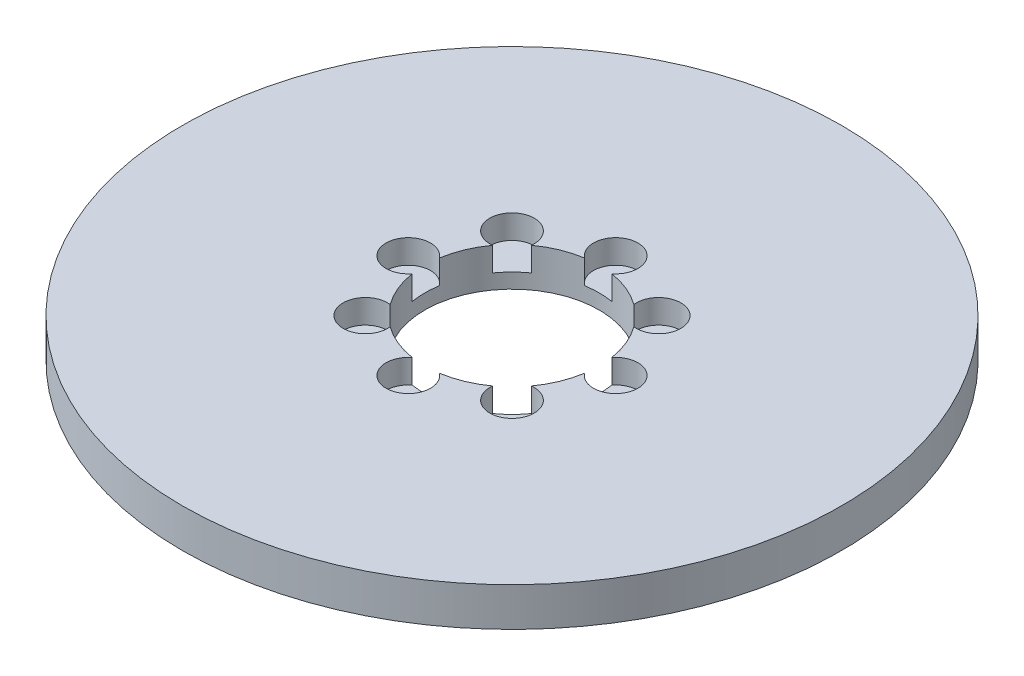
ISO-10303-21;
HEADER;
FILE_DESCRIPTION(('STEP AP214'),'2;1');
FILE_NAME('part.step','',(''),(''),'','','');
FILE_SCHEMA(('AUTOMOTIVE_DESIGN { 1 0 10303 214 1 1 1 1 }'));
ENDSEC;
DATA;
#1=APPLICATION_CONTEXT('core data for automotive mechanical design processes');
#2=APPLICATION_PROTOCOL_DEFINITION('international standard','automotive_design',2000,#1);
#3=PRODUCT_CONTEXT('',#1,'mechanical');
#4=PRODUCT('Part','Part','',(#3));
#5=PRODUCT_RELATED_PRODUCT_CATEGORY('part','',(#4));
#6=PRODUCT_DEFINITION_FORMATION('','',#4);
#7=PRODUCT_DEFINITION_CONTEXT('part definition',#1,'design');
#8=PRODUCT_DEFINITION('design','',#6,#7);
#9=PRODUCT_DEFINITION_SHAPE('','',#8);
#10=(LENGTH_UNIT() NAMED_UNIT(*) SI_UNIT(.MILLI.,.METRE.));
#11=(NAMED_UNIT(*) PLANE_ANGLE_UNIT() SI_UNIT($,.RADIAN.));
#12=(NAMED_UNIT(*) SI_UNIT($,.STERADIAN.) SOLID_ANGLE_UNIT());
#13=UNCERTAINTY_MEASURE_WITH_UNIT(LENGTH_MEASURE(1.E-05),#10,'distance_accuracy_value','');
#14=(GEOMETRIC_REPRESENTATION_CONTEXT(3) GLOBAL_UNCERTAINTY_ASSIGNED_CONTEXT((#13)) GLOBAL_UNIT_ASSIGNED_CONTEXT((#10,
#11,#12)) REPRESENTATION_CONTEXT('',''));
#15=CARTESIAN_POINT('',(0.,0.,0.));
#16=DIRECTION('',(0.,0.,1.));
#17=DIRECTION('',(1.,0.,0.));
#18=AXIS2_PLACEMENT_3D('',#15,#16,#17);
#19=CARTESIAN_POINT('',(0.,10.,0.));
#20=DIRECTION('',(0.,-1.,0.));
#21=DIRECTION('',(0.,0.,-1.));
#22=AXIS2_PLACEMENT_3D('',#19,#20,#21);
#23=CYLINDRICAL_SURFACE('',#22,85.);
#24=CARTESIAN_POINT('',(0.,10.,0.));
#25=DIRECTION('',(0.,1.,0.));
#26=DIRECTION('',(0.,0.,1.));
#27=AXIS2_PLACEMENT_3D('',#24,#25,#26);
#28=CIRCLE('',#27,85.);
#29=CARTESIAN_POINT('',(0.,10.,85.));
#30=VERTEX_POINT('',#29);
#31=EDGE_CURVE('E195',#30,#30,#28,.T.);
#32=ORIENTED_EDGE('',*,*,#31,.F.);
#33=EDGE_LOOP('',(#32));
#34=FACE_BOUND('',#33,.T.);
#35=CARTESIAN_POINT('',(0.,0.,0.));
#36=DIRECTION('',(0.,1.,0.));
#37=DIRECTION('',(0.,0.,1.));
#38=AXIS2_PLACEMENT_3D('',#35,#36,#37);
#39=CIRCLE('',#38,85.);
#40=CARTESIAN_POINT('',(0.,0.,85.));
#41=VERTEX_POINT('',#40);
#42=EDGE_CURVE('E179',#41,#41,#39,.T.);
#43=ORIENTED_EDGE('',*,*,#42,.T.);
#44=EDGE_LOOP('',(#43));
#45=FACE_BOUND('',#44,.T.);
#46=ADVANCED_FACE('F39',(#34,#45),#23,.T.);
#47=CARTESIAN_POINT('',(0.,10.,0.));
#48=DIRECTION('',(0.,1.,0.));
#49=DIRECTION('',(0.,0.,1.));
#50=AXIS2_PLACEMENT_3D('',#47,#48,#49);
#51=PLANE('',#50);
#52=CARTESIAN_POINT('',(0.,10.,26.7445196302618));
#53=DIRECTION('',(0.,1.,0.));
#54=DIRECTION('',(1.,0.,0.));
#55=AXIS2_PLACEMENT_3D('',#52,#53,#54);
#56=CIRCLE('',#55,5.72593359365455);
#57=CARTESIAN_POINT('',(-3.51425212942204,10.,22.2238617699727));
#58=VERTEX_POINT('',#57);
#59=CARTESIAN_POINT('',(3.5142521294222,10.,22.2238617699726));
#60=VERTEX_POINT('',#59);
#61=EDGE_CURVE('E176',#58,#60,#56,.T.);
#62=ORIENTED_EDGE('',*,*,#61,.F.);
#63=CARTESIAN_POINT('',(0.,10.,0.));
#64=DIRECTION('',(0.,1.,0.));
#65=DIRECTION('',(0.,0.,1.));
#66=AXIS2_PLACEMENT_3D('',#63,#64,#65);
#67=CIRCLE('',#66,22.5);
#68=CARTESIAN_POINT('',(-13.2296918501865,10.,18.1995948732138));
#69=VERTEX_POINT('',#68);
#70=EDGE_CURVE('E166',#69,#58,#67,.T.);
#71=ORIENTED_EDGE('',*,*,#70,.F.);
#72=CARTESIAN_POINT('',(-18.9112311901348,10.,18.9112311901349));
#73=DIRECTION('',(0.,1.,0.));
#74=DIRECTION('',(0.707106781186549,0.,0.707106781186546));
#75=AXIS2_PLACEMENT_3D('',#72,#73,#74);
#76=CIRCLE('',#75,5.72593359365455);
#77=CARTESIAN_POINT('',(-18.1995948732138,10.,13.2296918501865));
#78=VERTEX_POINT('',#77);
#79=EDGE_CURVE('E147',#78,#69,#76,.T.);
#80=ORIENTED_EDGE('',*,*,#79,.F.);
#81=CARTESIAN_POINT('',(-22.2238617699727,10.,3.51425212942212));
#82=VERTEX_POINT('',#81);
#83=EDGE_CURVE('E180',#82,#78,#67,.T.);
#84=ORIENTED_EDGE('',*,*,#83,.F.);
#85=CARTESIAN_POINT('',(-26.7445196302618,10.,0.));
#86=DIRECTION('',(0.,1.,0.));
#87=DIRECTION('',(0.,0.,1.));
#88=AXIS2_PLACEMENT_3D('',#85,#86,#87);
#89=CIRCLE('',#88,5.72593359365455);
#90=CARTESIAN_POINT('',(-22.2238617699727,10.,-3.51425212942212));
#91=VERTEX_POINT('',#90);
#92=EDGE_CURVE('E186',#91,#82,#89,.T.);
#93=ORIENTED_EDGE('',*,*,#92,.F.);
#94=CARTESIAN_POINT('',(-18.1995948732139,10.,-13.2296918501863));
#95=VERTEX_POINT('',#94);
#96=EDGE_CURVE('E182',#95,#91,#67,.T.);
#97=ORIENTED_EDGE('',*,*,#96,.F.);
#98=CARTESIAN_POINT('',(-18.9112311901351,10.,-18.9112311901346));
#99=DIRECTION('',(0.,1.,0.));
#100=DIRECTION('',(-0.707106781186539,0.,0.707106781186556));
#101=AXIS2_PLACEMENT_3D('',#98,#99,#100);
#102=CIRCLE('',#101,5.72593359365455);
#103=CARTESIAN_POINT('',(-13.2296918501867,10.,-18.1995948732136));
#104=VERTEX_POINT('',#103);
#105=EDGE_CURVE('E446',#104,#95,#102,.T.);
#106=ORIENTED_EDGE('',*,*,#105,.F.);
#107=CARTESIAN_POINT('',(-3.51425212942235,10.,-22.2238617699726));
#108=VERTEX_POINT('',#107);
#109=EDGE_CURVE('E452',#108,#104,#67,.T.);
#110=ORIENTED_EDGE('',*,*,#109,.F.);
#111=CARTESIAN_POINT('',(-2.80133973616149E-13,10.,-26.7445196302618));
#112=DIRECTION('',(0.,1.,0.));
#113=DIRECTION('',(-1.,0.,0.));
#114=AXIS2_PLACEMENT_3D('',#111,#112,#113);
#115=CIRCLE('',#114,5.72593359365455);
#116=CARTESIAN_POINT('',(3.51425212942189,10.,-22.2238617699727));
#117=VERTEX_POINT('',#116);
#118=EDGE_CURVE('E477',#117,#108,#115,.T.);
#119=ORIENTED_EDGE('',*,*,#118,.F.);
#120=CARTESIAN_POINT('',(13.2296918501863,10.,-18.1995948732139));
#121=VERTEX_POINT('',#120);
#122=EDGE_CURVE('E460',#121,#117,#67,.T.);
#123=ORIENTED_EDGE('',*,*,#122,.F.);
#124=CARTESIAN_POINT('',(18.9112311901347,10.,-18.911231190135));
#125=DIRECTION('',(0.,1.,0.));
#126=DIRECTION('',(-0.707106781186554,0.,-0.707106781186541));
#127=AXIS2_PLACEMENT_3D('',#124,#125,#126);
#128=CIRCLE('',#127,5.72593359365455);
#129=CARTESIAN_POINT('',(18.1995948732137,10.,-13.2296918501866));
#130=VERTEX_POINT('',#129);
#131=EDGE_CURVE('E464',#130,#121,#128,.T.);
#132=ORIENTED_EDGE('',*,*,#131,.F.);
#133=CARTESIAN_POINT('',(22.2238617699727,10.,-3.51425212942212));
#134=VERTEX_POINT('',#133);
#135=EDGE_CURVE('E459',#134,#130,#67,.T.);
#136=ORIENTED_EDGE('',*,*,#135,.F.);
#137=CARTESIAN_POINT('',(26.7445196302618,10.,0.));
#138=DIRECTION('',(0.,1.,0.));
#139=DIRECTION('',(0.,0.,-1.));
#140=AXIS2_PLACEMENT_3D('',#137,#138,#139);
#141=CIRCLE('',#140,5.72593359365455);
#142=CARTESIAN_POINT('',(22.2238617699727,10.,3.51425212942212));
#143=VERTEX_POINT('',#142);
#144=EDGE_CURVE('E469',#143,#134,#141,.T.);
#145=ORIENTED_EDGE('',*,*,#144,.F.);
#146=CARTESIAN_POINT('',(18.1995948732139,10.,13.2296918501864));
#147=VERTEX_POINT('',#146);
#148=EDGE_CURVE('E181',#147,#143,#67,.T.);
#149=ORIENTED_EDGE('',*,*,#148,.F.);
#150=CARTESIAN_POINT('',(18.9112311901349,10.,18.9112311901347));
#151=DIRECTION('',(0.,1.,0.));
#152=DIRECTION('',(0.707106781186544,0.,-0.707106781186551));
#153=AXIS2_PLACEMENT_3D('',#150,#151,#152);
#154=CIRCLE('',#153,5.72593359365455);
#155=CARTESIAN_POINT('',(13.2296918501866,10.,18.1995948732137));
#156=VERTEX_POINT('',#155);
#157=EDGE_CURVE('E475',#156,#147,#154,.T.);
#158=ORIENTED_EDGE('',*,*,#157,.F.);
#159=EDGE_CURVE('E177',#60,#156,#67,.T.);
#160=ORIENTED_EDGE('',*,*,#159,.F.);
#161=EDGE_LOOP('',(#62,#71,#80,#84,#93,#97,#106,#110,#119,#123,#132,#136,#145,#149,#158,#160));
#162=FACE_BOUND('',#161,.T.);
#163=ORIENTED_EDGE('',*,*,#31,.T.);
#164=EDGE_LOOP('',(#163));
#165=FACE_BOUND('',#164,.T.);
#166=ADVANCED_FACE('F172',(#162,#165),#51,.T.);
#167=CARTESIAN_POINT('',(0.,0.,0.));
#168=DIRECTION('',(0.,1.,0.));
#169=DIRECTION('',(0.,0.,1.));
#170=AXIS2_PLACEMENT_3D('',#167,#168,#169);
#171=PLANE('',#170);
#172=CARTESIAN_POINT('',(0.,0.,0.));
#173=DIRECTION('',(0.,1.,0.));
#174=DIRECTION('',(0.,0.,1.));
#175=AXIS2_PLACEMENT_3D('',#172,#173,#174);
#176=CIRCLE('',#175,22.5);
#177=CARTESIAN_POINT('',(0.,0.,22.5));
#178=VERTEX_POINT('',#177);
#179=EDGE_CURVE('E187',#178,#178,#176,.T.);
#180=ORIENTED_EDGE('',*,*,#179,.T.);
#181=EDGE_LOOP('',(#180));
#182=FACE_BOUND('',#181,.T.);
#183=ORIENTED_EDGE('',*,*,#42,.F.);
#184=EDGE_LOOP('',(#183));
#185=FACE_BOUND('',#184,.T.);
#186=ADVANCED_FACE('F270',(#182,#185),#171,.F.);
#187=CARTESIAN_POINT('',(0.,10.,0.));
#188=DIRECTION('',(0.,-1.,0.));
#189=DIRECTION('',(0.,0.,-1.));
#190=AXIS2_PLACEMENT_3D('',#187,#188,#189);
#191=CYLINDRICAL_SURFACE('',#190,22.5);
#192=DIRECTION('',(0.,1.,0.));
#193=VECTOR('',#192,1.);
#194=CARTESIAN_POINT('',(-3.51425212942203,6.91487018488435,22.2238617699727));
#195=LINE('',#194,#193);
#196=CARTESIAN_POINT('',(-3.51425212942204,3.82974036976871,22.2238617699727));
#197=VERTEX_POINT('',#196);
#198=EDGE_CURVE('E11',#197,#58,#195,.T.);
#199=ORIENTED_EDGE('',*,*,#198,.F.);
#200=CARTESIAN_POINT('',(0.,3.82974036976871,0.));
#201=DIRECTION('',(0.,1.,0.));
#202=DIRECTION('',(0.,0.,1.));
#203=AXIS2_PLACEMENT_3D('',#200,#201,#202);
#204=CIRCLE('',#203,22.5);
#205=CARTESIAN_POINT('',(3.5142521294222,3.82974036976871,22.2238617699726));
#206=VERTEX_POINT('',#205);
#207=EDGE_CURVE('E250',#197,#206,#204,.T.);
#208=ORIENTED_EDGE('',*,*,#207,.T.);
#209=DIRECTION('',(0.,1.,0.));
#210=VECTOR('',#209,1.);
#211=CARTESIAN_POINT('',(3.51425212942219,6.91487018488435,22.2238617699726));
#212=LINE('',#211,#210);
#213=EDGE_CURVE('E46',#60,#206,#212,.F.);
#214=ORIENTED_EDGE('',*,*,#213,.F.);
#215=ORIENTED_EDGE('',*,*,#159,.T.);
#216=DIRECTION('',(0.,1.,0.));
#217=VECTOR('',#216,1.);
#218=CARTESIAN_POINT('',(13.2296918501866,6.91487018488435,18.1995948732137));
#219=LINE('',#218,#217);
#220=CARTESIAN_POINT('',(13.2296918501866,3.82974036976871,18.1995948732137));
#221=VERTEX_POINT('',#220);
#222=EDGE_CURVE('E244',#221,#156,#219,.T.);
#223=ORIENTED_EDGE('',*,*,#222,.F.);
#224=CARTESIAN_POINT('',(0.,3.82974036976871,0.));
#225=DIRECTION('',(0.,1.,0.));
#226=DIRECTION('',(0.,0.,1.));
#227=AXIS2_PLACEMENT_3D('',#224,#225,#226);
#228=CIRCLE('',#227,22.5);
#229=CARTESIAN_POINT('',(18.1995948732139,3.82974036976871,13.2296918501864));
#230=VERTEX_POINT('',#229);
#231=EDGE_CURVE('E238',#221,#230,#228,.T.);
#232=ORIENTED_EDGE('',*,*,#231,.T.);
#233=DIRECTION('',(0.,1.,0.));
#234=VECTOR('',#233,1.);
#235=CARTESIAN_POINT('',(18.1995948732138,6.91487018488435,13.2296918501864));
#236=LINE('',#235,#234);
#237=EDGE_CURVE('E242',#147,#230,#236,.F.);
#238=ORIENTED_EDGE('',*,*,#237,.F.);
#239=ORIENTED_EDGE('',*,*,#148,.T.);
#240=DIRECTION('',(0.,1.,0.));
#241=VECTOR('',#240,1.);
#242=CARTESIAN_POINT('',(22.2238617699727,6.91487018488435,3.51425212942211));
#243=LINE('',#242,#241);
#244=CARTESIAN_POINT('',(22.2238617699727,3.82974036976871,3.51425212942212));
#245=VERTEX_POINT('',#244);
#246=EDGE_CURVE('E236',#245,#143,#243,.T.);
#247=ORIENTED_EDGE('',*,*,#246,.F.);
#248=CARTESIAN_POINT('',(0.,3.82974036976871,0.));
#249=DIRECTION('',(0.,1.,0.));
#250=DIRECTION('',(0.,0.,1.));
#251=AXIS2_PLACEMENT_3D('',#248,#249,#250);
#252=CIRCLE('',#251,22.5);
#253=CARTESIAN_POINT('',(22.2238617699727,3.82974036976871,-3.51425212942212));
#254=VERTEX_POINT('',#253);
#255=EDGE_CURVE('E235',#245,#254,#252,.T.);
#256=ORIENTED_EDGE('',*,*,#255,.T.);
#257=DIRECTION('',(0.,1.,0.));
#258=VECTOR('',#257,1.);
#259=CARTESIAN_POINT('',(22.2238617699727,6.91487018488435,-3.51425212942211));
#260=LINE('',#259,#258);
#261=EDGE_CURVE('E234',#134,#254,#260,.F.);
#262=ORIENTED_EDGE('',*,*,#261,.F.);
#263=ORIENTED_EDGE('',*,*,#135,.T.);
#264=DIRECTION('',(0.,1.,0.));
#265=VECTOR('',#264,1.);
#266=CARTESIAN_POINT('',(18.1995948732137,6.91487018488435,-13.2296918501866));
#267=LINE('',#266,#265);
#268=CARTESIAN_POINT('',(18.1995948732137,3.82974036976871,-13.2296918501866));
#269=VERTEX_POINT('',#268);
#270=EDGE_CURVE('E229',#269,#130,#267,.T.);
#271=ORIENTED_EDGE('',*,*,#270,.F.);
#272=CARTESIAN_POINT('',(0.,3.82974036976871,0.));
#273=DIRECTION('',(0.,1.,0.));
#274=DIRECTION('',(0.,0.,1.));
#275=AXIS2_PLACEMENT_3D('',#272,#273,#274);
#276=CIRCLE('',#275,22.5);
#277=CARTESIAN_POINT('',(13.2296918501863,3.82974036976871,-18.1995948732139));
#278=VERTEX_POINT('',#277);
#279=EDGE_CURVE('E221',#269,#278,#276,.T.);
#280=ORIENTED_EDGE('',*,*,#279,.T.);
#281=DIRECTION('',(0.,1.,0.));
#282=VECTOR('',#281,1.);
#283=CARTESIAN_POINT('',(13.2296918501863,6.91487018488435,-18.1995948732139));
#284=LINE('',#283,#282);
#285=EDGE_CURVE('E230',#121,#278,#284,.F.);
#286=ORIENTED_EDGE('',*,*,#285,.F.);
#287=ORIENTED_EDGE('',*,*,#122,.T.);
#288=DIRECTION('',(0.,1.,0.));
#289=VECTOR('',#288,1.);
#290=CARTESIAN_POINT('',(3.51425212942187,6.91487018488435,-22.2238617699727));
#291=LINE('',#290,#289);
#292=CARTESIAN_POINT('',(3.51425212942189,3.82974036976871,-22.2238617699727));
#293=VERTEX_POINT('',#292);
#294=EDGE_CURVE('E225',#293,#117,#291,.T.);
#295=ORIENTED_EDGE('',*,*,#294,.F.);
#296=CARTESIAN_POINT('',(0.,3.82974036976871,0.));
#297=DIRECTION('',(0.,1.,0.));
#298=DIRECTION('',(0.,0.,1.));
#299=AXIS2_PLACEMENT_3D('',#296,#297,#298);
#300=CIRCLE('',#299,22.5);
#301=CARTESIAN_POINT('',(-3.51425212942235,3.82974036976871,-22.2238617699726));
#302=VERTEX_POINT('',#301);
#303=EDGE_CURVE('E216',#293,#302,#300,.T.);
#304=ORIENTED_EDGE('',*,*,#303,.T.);
#305=DIRECTION('',(0.,1.,0.));
#306=VECTOR('',#305,1.);
#307=CARTESIAN_POINT('',(-3.51425212942234,6.91487018488435,-22.2238617699726));
#308=LINE('',#307,#306);
#309=EDGE_CURVE('E218',#108,#302,#308,.F.);
#310=ORIENTED_EDGE('',*,*,#309,.F.);
#311=ORIENTED_EDGE('',*,*,#109,.T.);
#312=DIRECTION('',(0.,1.,0.));
#313=VECTOR('',#312,1.);
#314=CARTESIAN_POINT('',(-13.2296918501867,6.91487018488435,-18.1995948732136));
#315=LINE('',#314,#313);
#316=CARTESIAN_POINT('',(-13.2296918501867,3.82974036976871,-18.1995948732136));
#317=VERTEX_POINT('',#316);
#318=EDGE_CURVE('E212',#317,#104,#315,.T.);
#319=ORIENTED_EDGE('',*,*,#318,.F.);
#320=CARTESIAN_POINT('',(0.,3.82974036976871,0.));
#321=DIRECTION('',(0.,1.,0.));
#322=DIRECTION('',(0.,0.,1.));
#323=AXIS2_PLACEMENT_3D('',#320,#321,#322);
#324=CIRCLE('',#323,22.5);
#325=CARTESIAN_POINT('',(-18.1995948732139,3.82974036976871,-13.2296918501863));
#326=VERTEX_POINT('',#325);
#327=EDGE_CURVE('E208',#317,#326,#324,.T.);
#328=ORIENTED_EDGE('',*,*,#327,.T.);
#329=DIRECTION('',(0.,1.,0.));
#330=VECTOR('',#329,1.);
#331=CARTESIAN_POINT('',(-18.1995948732139,6.91487018488435,-13.2296918501863));
#332=LINE('',#331,#330);
#333=EDGE_CURVE('E211',#95,#326,#332,.F.);
#334=ORIENTED_EDGE('',*,*,#333,.F.);
#335=ORIENTED_EDGE('',*,*,#96,.T.);
#336=DIRECTION('',(0.,1.,0.));
#337=VECTOR('',#336,1.);
#338=CARTESIAN_POINT('',(-22.2238617699727,6.91487018488435,-3.51425212942211));
#339=LINE('',#338,#337);
#340=CARTESIAN_POINT('',(-22.2238617699727,3.82974036976871,-3.51425212942212));
#341=VERTEX_POINT('',#340);
#342=EDGE_CURVE('E201',#341,#91,#339,.T.);
#343=ORIENTED_EDGE('',*,*,#342,.F.);
#344=CARTESIAN_POINT('',(0.,3.82974036976871,0.));
#345=DIRECTION('',(0.,1.,0.));
#346=DIRECTION('',(0.,0.,1.));
#347=AXIS2_PLACEMENT_3D('',#344,#345,#346);
#348=CIRCLE('',#347,22.5);
#349=CARTESIAN_POINT('',(-22.2238617699727,3.82974036976871,3.51425212942212));
#350=VERTEX_POINT('',#349);
#351=EDGE_CURVE('E194',#341,#350,#348,.T.);
#352=ORIENTED_EDGE('',*,*,#351,.T.);
#353=DIRECTION('',(0.,1.,0.));
#354=VECTOR('',#353,1.);
#355=CARTESIAN_POINT('',(-22.2238617699727,6.91487018488435,3.51425212942211));
#356=LINE('',#355,#354);
#357=EDGE_CURVE('E199',#82,#350,#356,.F.);
#358=ORIENTED_EDGE('',*,*,#357,.F.);
#359=ORIENTED_EDGE('',*,*,#83,.T.);
#360=DIRECTION('',(0.,1.,0.));
#361=VECTOR('',#360,1.);
#362=CARTESIAN_POINT('',(-18.1995948732137,6.91487018488435,13.2296918501865));
#363=LINE('',#362,#361);
#364=CARTESIAN_POINT('',(-18.1995948732138,3.82974036976871,13.2296918501865));
#365=VERTEX_POINT('',#364);
#366=EDGE_CURVE('E160',#365,#78,#363,.T.);
#367=ORIENTED_EDGE('',*,*,#366,.F.);
#368=CARTESIAN_POINT('',(0.,3.82974036976871,0.));
#369=DIRECTION('',(0.,1.,0.));
#370=DIRECTION('',(0.,0.,1.));
#371=AXIS2_PLACEMENT_3D('',#368,#369,#370);
#372=CIRCLE('',#371,22.5);
#373=CARTESIAN_POINT('',(-13.2296918501865,3.82974036976871,18.1995948732138));
#374=VERTEX_POINT('',#373);
#375=EDGE_CURVE('E168',#365,#374,#372,.T.);
#376=ORIENTED_EDGE('',*,*,#375,.T.);
#377=DIRECTION('',(0.,1.,0.));
#378=VECTOR('',#377,1.);
#379=CARTESIAN_POINT('',(-13.2296918501865,6.91487018488435,18.1995948732138));
#380=LINE('',#379,#378);
#381=EDGE_CURVE('E152',#69,#374,#380,.F.);
#382=ORIENTED_EDGE('',*,*,#381,.F.);
#383=ORIENTED_EDGE('',*,*,#70,.T.);
#384=EDGE_LOOP('',(#199,#208,#214,#215,#223,#232,#238,#239,#247,#256,#262,#263,#271,#280,#286,
#287,#295,#304,#310,#311,#319,#328,#334,#335,#343,#352,#358,#359,#367,#376,#382,#383));
#385=FACE_BOUND('',#384,.T.);
#386=ORIENTED_EDGE('',*,*,#179,.F.);
#387=EDGE_LOOP('',(#386));
#388=FACE_BOUND('',#387,.T.);
#389=ADVANCED_FACE('F170',(#385,#388),#191,.F.);
#390=CARTESIAN_POINT('',(-26.7445196302618,3.82974036976871,0.));
#391=DIRECTION('',(0.,1.,0.));
#392=DIRECTION('',(0.,0.,1.));
#393=AXIS2_PLACEMENT_3D('',#390,#391,#392);
#394=CYLINDRICAL_SURFACE('',#393,5.72593359365455);
#395=ORIENTED_EDGE('',*,*,#342,.T.);
#396=ORIENTED_EDGE('',*,*,#92,.T.);
#397=ORIENTED_EDGE('',*,*,#357,.T.);
#398=CARTESIAN_POINT('',(-26.7445196302618,3.82974036976871,0.));
#399=DIRECTION('',(0.,1.,0.));
#400=DIRECTION('',(0.,0.,1.));
#401=AXIS2_PLACEMENT_3D('',#398,#399,#400);
#402=CIRCLE('',#401,5.72593359365455);
#403=EDGE_CURVE('E191',#341,#350,#402,.T.);
#404=ORIENTED_EDGE('',*,*,#403,.F.);
#405=EDGE_LOOP('',(#395,#396,#397,#404));
#406=FACE_BOUND('',#405,.T.);
#407=ADVANCED_FACE('F279',(#406),#394,.F.);
#408=CARTESIAN_POINT('',(-26.7445196302618,3.82974036976871,0.));
#409=DIRECTION('',(0.,1.,0.));
#410=DIRECTION('',(0.,0.,1.));
#411=AXIS2_PLACEMENT_3D('',#408,#409,#410);
#412=PLANE('',#411);
#413=ORIENTED_EDGE('',*,*,#403,.T.);
#414=ORIENTED_EDGE('',*,*,#351,.F.);
#415=EDGE_LOOP('',(#413,#414));
#416=FACE_BOUND('',#415,.T.);
#417=ADVANCED_FACE('F285',(#416),#412,.T.);
#418=CARTESIAN_POINT('',(-18.9112311901348,3.82974036976871,18.9112311901349));
#419=DIRECTION('',(0.,1.,0.));
#420=DIRECTION('',(0.,0.,1.));
#421=AXIS2_PLACEMENT_3D('',#418,#419,#420);
#422=CYLINDRICAL_SURFACE('',#421,5.72593359365455);
#423=ORIENTED_EDGE('',*,*,#366,.T.);
#424=ORIENTED_EDGE('',*,*,#79,.T.);
#425=ORIENTED_EDGE('',*,*,#381,.T.);
#426=CARTESIAN_POINT('',(-18.9112311901348,3.82974036976871,18.9112311901349));
#427=DIRECTION('',(0.,1.,0.));
#428=DIRECTION('',(0.707106781186549,0.,0.707106781186546));
#429=AXIS2_PLACEMENT_3D('',#426,#427,#428);
#430=CIRCLE('',#429,5.72593359365455);
#431=EDGE_CURVE('E165',#365,#374,#430,.T.);
#432=ORIENTED_EDGE('',*,*,#431,.F.);
#433=EDGE_LOOP('',(#423,#424,#425,#432));
#434=FACE_BOUND('',#433,.T.);
#435=ADVANCED_FACE('F155',(#434),#422,.F.);
#436=CARTESIAN_POINT('',(-18.9112311901348,3.82974036976871,18.9112311901349));
#437=DIRECTION('',(0.,1.,0.));
#438=DIRECTION('',(0.707106781186549,0.,0.707106781186546));
#439=AXIS2_PLACEMENT_3D('',#436,#437,#438);
#440=PLANE('',#439);
#441=ORIENTED_EDGE('',*,*,#431,.T.);
#442=ORIENTED_EDGE('',*,*,#375,.F.);
#443=EDGE_LOOP('',(#441,#442));
#444=FACE_BOUND('',#443,.T.);
#445=ADVANCED_FACE('F288',(#444),#440,.T.);
#446=CARTESIAN_POINT('',(-18.9112311901351,3.82974036976871,-18.9112311901346));
#447=DIRECTION('',(0.,1.,0.));
#448=DIRECTION('',(0.,0.,1.));
#449=AXIS2_PLACEMENT_3D('',#446,#447,#448);
#450=CYLINDRICAL_SURFACE('',#449,5.72593359365455);
#451=ORIENTED_EDGE('',*,*,#318,.T.);
#452=ORIENTED_EDGE('',*,*,#105,.T.);
#453=ORIENTED_EDGE('',*,*,#333,.T.);
#454=CARTESIAN_POINT('',(-18.9112311901351,3.82974036976871,-18.9112311901346));
#455=DIRECTION('',(0.,1.,0.));
#456=DIRECTION('',(-0.707106781186539,0.,0.707106781186556));
#457=AXIS2_PLACEMENT_3D('',#454,#455,#456);
#458=CIRCLE('',#457,5.72593359365455);
#459=EDGE_CURVE('E447',#317,#326,#458,.T.);
#460=ORIENTED_EDGE('',*,*,#459,.F.);
#461=EDGE_LOOP('',(#451,#452,#453,#460));
#462=FACE_BOUND('',#461,.T.);
#463=ADVANCED_FACE('F295',(#462),#450,.F.);
#464=CARTESIAN_POINT('',(-18.9112311901351,3.82974036976871,-18.9112311901346));
#465=DIRECTION('',(0.,1.,0.));
#466=DIRECTION('',(-0.707106781186539,0.,0.707106781186556));
#467=AXIS2_PLACEMENT_3D('',#464,#465,#466);
#468=PLANE('',#467);
#469=ORIENTED_EDGE('',*,*,#459,.T.);
#470=ORIENTED_EDGE('',*,*,#327,.F.);
#471=EDGE_LOOP('',(#469,#470));
#472=FACE_BOUND('',#471,.T.);
#473=ADVANCED_FACE('F375',(#472),#468,.T.);
#474=CARTESIAN_POINT('',(-2.80133973616149E-13,3.82974036976871,-26.7445196302618));
#475=DIRECTION('',(0.,1.,0.));
#476=DIRECTION('',(0.,0.,1.));
#477=AXIS2_PLACEMENT_3D('',#474,#475,#476);
#478=CYLINDRICAL_SURFACE('',#477,5.72593359365455);
#479=ORIENTED_EDGE('',*,*,#294,.T.);
#480=ORIENTED_EDGE('',*,*,#118,.T.);
#481=ORIENTED_EDGE('',*,*,#309,.T.);
#482=CARTESIAN_POINT('',(-2.80133973616149E-13,3.82974036976871,-26.7445196302618));
#483=DIRECTION('',(0.,1.,0.));
#484=DIRECTION('',(-1.,0.,0.));
#485=AXIS2_PLACEMENT_3D('',#482,#483,#484);
#486=CIRCLE('',#485,5.72593359365455);
#487=EDGE_CURVE('E467',#293,#302,#486,.T.);
#488=ORIENTED_EDGE('',*,*,#487,.F.);
#489=EDGE_LOOP('',(#479,#480,#481,#488));
#490=FACE_BOUND('',#489,.T.);
#491=ADVANCED_FACE('F361',(#490),#478,.F.);
#492=CARTESIAN_POINT('',(-2.80133973616149E-13,3.82974036976871,-26.7445196302618));
#493=DIRECTION('',(0.,1.,0.));
#494=DIRECTION('',(-1.,0.,0.));
#495=AXIS2_PLACEMENT_3D('',#492,#493,#494);
#496=PLANE('',#495);
#497=ORIENTED_EDGE('',*,*,#487,.T.);
#498=ORIENTED_EDGE('',*,*,#303,.F.);
#499=EDGE_LOOP('',(#497,#498));
#500=FACE_BOUND('',#499,.T.);
#501=ADVANCED_FACE('F297',(#500),#496,.T.);
#502=CARTESIAN_POINT('',(18.9112311901347,3.82974036976871,-18.911231190135));
#503=DIRECTION('',(0.,1.,0.));
#504=DIRECTION('',(0.,0.,1.));
#505=AXIS2_PLACEMENT_3D('',#502,#503,#504);
#506=CYLINDRICAL_SURFACE('',#505,5.72593359365455);
#507=ORIENTED_EDGE('',*,*,#270,.T.);
#508=ORIENTED_EDGE('',*,*,#131,.T.);
#509=ORIENTED_EDGE('',*,*,#285,.T.);
#510=CARTESIAN_POINT('',(18.9112311901347,3.82974036976871,-18.911231190135));
#511=DIRECTION('',(0.,1.,0.));
#512=DIRECTION('',(-0.707106781186554,0.,-0.707106781186541));
#513=AXIS2_PLACEMENT_3D('',#510,#511,#512);
#514=CIRCLE('',#513,5.72593359365455);
#515=EDGE_CURVE('E470',#269,#278,#514,.T.);
#516=ORIENTED_EDGE('',*,*,#515,.F.);
#517=EDGE_LOOP('',(#507,#508,#509,#516));
#518=FACE_BOUND('',#517,.T.);
#519=ADVANCED_FACE('F294',(#518),#506,.F.);
#520=CARTESIAN_POINT('',(18.9112311901347,3.82974036976871,-18.911231190135));
#521=DIRECTION('',(0.,1.,0.));
#522=DIRECTION('',(-0.707106781186554,0.,-0.707106781186541));
#523=AXIS2_PLACEMENT_3D('',#520,#521,#522);
#524=PLANE('',#523);
#525=ORIENTED_EDGE('',*,*,#515,.T.);
#526=ORIENTED_EDGE('',*,*,#279,.F.);
#527=EDGE_LOOP('',(#525,#526));
#528=FACE_BOUND('',#527,.T.);
#529=ADVANCED_FACE('F300',(#528),#524,.T.);
#530=CARTESIAN_POINT('',(26.7445196302618,3.82974036976871,0.));
#531=DIRECTION('',(0.,1.,0.));
#532=DIRECTION('',(0.,0.,1.));
#533=AXIS2_PLACEMENT_3D('',#530,#531,#532);
#534=CYLINDRICAL_SURFACE('',#533,5.72593359365455);
#535=ORIENTED_EDGE('',*,*,#246,.T.);
#536=ORIENTED_EDGE('',*,*,#144,.T.);
#537=ORIENTED_EDGE('',*,*,#261,.T.);
#538=CARTESIAN_POINT('',(26.7445196302618,3.82974036976871,0.));
#539=DIRECTION('',(0.,1.,0.));
#540=DIRECTION('',(0.,0.,-1.));
#541=AXIS2_PLACEMENT_3D('',#538,#539,#540);
#542=CIRCLE('',#541,5.72593359365455);
#543=EDGE_CURVE('E472',#245,#254,#542,.T.);
#544=ORIENTED_EDGE('',*,*,#543,.F.);
#545=EDGE_LOOP('',(#535,#536,#537,#544));
#546=FACE_BOUND('',#545,.T.);
#547=ADVANCED_FACE('F305',(#546),#534,.F.);
#548=CARTESIAN_POINT('',(26.7445196302618,3.82974036976871,0.));
#549=DIRECTION('',(0.,1.,0.));
#550=DIRECTION('',(0.,0.,-1.));
#551=AXIS2_PLACEMENT_3D('',#548,#549,#550);
#552=PLANE('',#551);
#553=ORIENTED_EDGE('',*,*,#543,.T.);
#554=ORIENTED_EDGE('',*,*,#255,.F.);
#555=EDGE_LOOP('',(#553,#554));
#556=FACE_BOUND('',#555,.T.);
#557=ADVANCED_FACE('F308',(#556),#552,.T.);
#558=CARTESIAN_POINT('',(18.9112311901349,3.82974036976871,18.9112311901347));
#559=DIRECTION('',(0.,1.,0.));
#560=DIRECTION('',(0.,0.,1.));
#561=AXIS2_PLACEMENT_3D('',#558,#559,#560);
#562=CYLINDRICAL_SURFACE('',#561,5.72593359365455);
#563=ORIENTED_EDGE('',*,*,#222,.T.);
#564=ORIENTED_EDGE('',*,*,#157,.T.);
#565=ORIENTED_EDGE('',*,*,#237,.T.);
#566=CARTESIAN_POINT('',(18.9112311901349,3.82974036976871,18.9112311901347));
#567=DIRECTION('',(0.,1.,0.));
#568=DIRECTION('',(0.707106781186544,0.,-0.707106781186551));
#569=AXIS2_PLACEMENT_3D('',#566,#567,#568);
#570=CIRCLE('',#569,5.72593359365455);
#571=EDGE_CURVE('E56',#221,#230,#570,.T.);
#572=ORIENTED_EDGE('',*,*,#571,.F.);
#573=EDGE_LOOP('',(#563,#564,#565,#572));
#574=FACE_BOUND('',#573,.T.);
#575=ADVANCED_FACE('F309',(#574),#562,.F.);
#576=CARTESIAN_POINT('',(18.9112311901349,3.82974036976871,18.9112311901347));
#577=DIRECTION('',(0.,1.,0.));
#578=DIRECTION('',(0.707106781186544,0.,-0.707106781186551));
#579=AXIS2_PLACEMENT_3D('',#576,#577,#578);
#580=PLANE('',#579);
#581=ORIENTED_EDGE('',*,*,#571,.T.);
#582=ORIENTED_EDGE('',*,*,#231,.F.);
#583=EDGE_LOOP('',(#581,#582));
#584=FACE_BOUND('',#583,.T.);
#585=ADVANCED_FACE('F256',(#584),#580,.T.);
#586=CARTESIAN_POINT('',(0.,3.82974036976871,26.7445196302618));
#587=DIRECTION('',(0.,1.,0.));
#588=DIRECTION('',(0.,0.,1.));
#589=AXIS2_PLACEMENT_3D('',#586,#587,#588);
#590=CYLINDRICAL_SURFACE('',#589,5.72593359365455);
#591=ORIENTED_EDGE('',*,*,#198,.T.);
#592=ORIENTED_EDGE('',*,*,#61,.T.);
#593=ORIENTED_EDGE('',*,*,#213,.T.);
#594=CARTESIAN_POINT('',(0.,3.82974036976871,26.7445196302618));
#595=DIRECTION('',(0.,1.,0.));
#596=DIRECTION('',(1.,0.,0.));
#597=AXIS2_PLACEMENT_3D('',#594,#595,#596);
#598=CIRCLE('',#597,5.72593359365455);
#599=EDGE_CURVE('E55',#197,#206,#598,.T.);
#600=ORIENTED_EDGE('',*,*,#599,.F.);
#601=EDGE_LOOP('',(#591,#592,#593,#600));
#602=FACE_BOUND('',#601,.T.);
#603=ADVANCED_FACE('F253',(#602),#590,.F.);
#604=CARTESIAN_POINT('',(0.,3.82974036976871,26.7445196302618));
#605=DIRECTION('',(0.,1.,0.));
#606=DIRECTION('',(1.,0.,0.));
#607=AXIS2_PLACEMENT_3D('',#604,#605,#606);
#608=PLANE('',#607);
#609=ORIENTED_EDGE('',*,*,#599,.T.);
#610=ORIENTED_EDGE('',*,*,#207,.F.);
#611=EDGE_LOOP('',(#609,#610));
#612=FACE_BOUND('',#611,.T.);
#613=ADVANCED_FACE('F252',(#612),#608,.T.);
#614=CLOSED_SHELL('',(#46,#166,#186,#389,#407,#417,#435,#445,#463,#473,#491,#501,#519,#529,#547,
#557,#575,#585,#603,#613));
#615=MANIFOLD_SOLID_BREP('B2',#614);
#616=ADVANCED_BREP_SHAPE_REPRESENTATION('',(#18,#615),#14);
#617=SHAPE_DEFINITION_REPRESENTATION(#9,#616);
ENDSEC;
END-ISO-10303-21;
